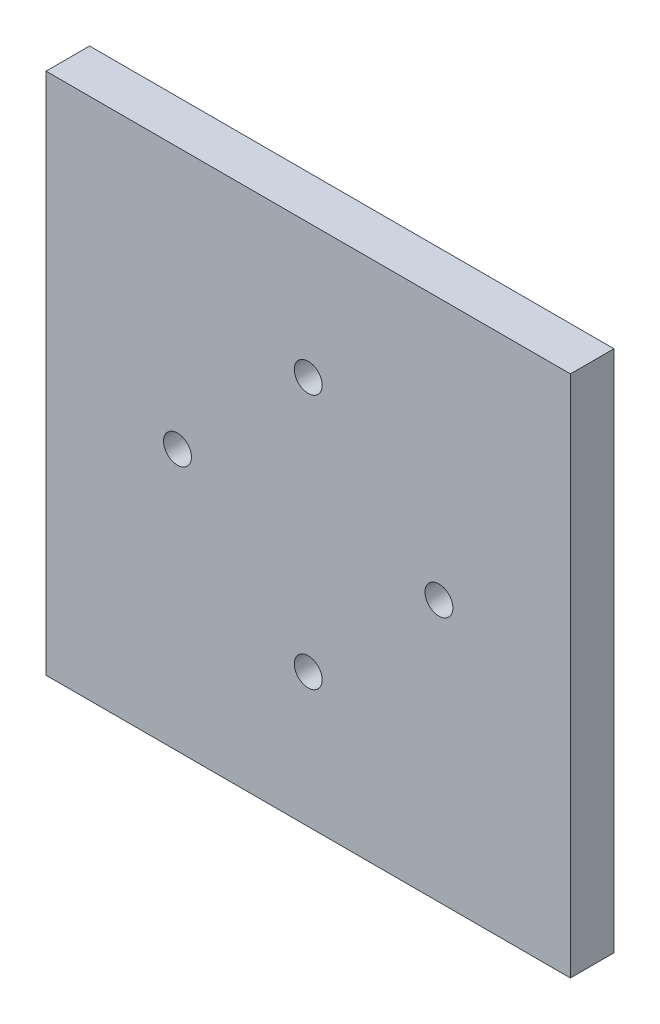
ISO-10303-21;
HEADER;
FILE_DESCRIPTION(('STEP AP214'),'2;1');
FILE_NAME('part.step','',(''),(''),'','','');
FILE_SCHEMA(('AUTOMOTIVE_DESIGN { 1 0 10303 214 1 1 1 1 }'));
ENDSEC;
DATA;
#1=APPLICATION_CONTEXT('core data for automotive mechanical design processes');
#2=APPLICATION_PROTOCOL_DEFINITION('international standard','automotive_design',2000,#1);
#3=PRODUCT_CONTEXT('',#1,'mechanical');
#4=PRODUCT('Part','Part','',(#3));
#5=PRODUCT_RELATED_PRODUCT_CATEGORY('part','',(#4));
#6=PRODUCT_DEFINITION_FORMATION('','',#4);
#7=PRODUCT_DEFINITION_CONTEXT('part definition',#1,'design');
#8=PRODUCT_DEFINITION('design','',#6,#7);
#9=PRODUCT_DEFINITION_SHAPE('','',#8);
#10=(LENGTH_UNIT() NAMED_UNIT(*) SI_UNIT(.MILLI.,.METRE.));
#11=(NAMED_UNIT(*) PLANE_ANGLE_UNIT() SI_UNIT($,.RADIAN.));
#12=(NAMED_UNIT(*) SI_UNIT($,.STERADIAN.) SOLID_ANGLE_UNIT());
#13=UNCERTAINTY_MEASURE_WITH_UNIT(LENGTH_MEASURE(1.E-05),#10,'distance_accuracy_value','');
#14=(GEOMETRIC_REPRESENTATION_CONTEXT(3) GLOBAL_UNCERTAINTY_ASSIGNED_CONTEXT((#13)) GLOBAL_UNIT_ASSIGNED_CONTEXT((#10,
#11,#12)) REPRESENTATION_CONTEXT('',''));
#15=CARTESIAN_POINT('',(0.,0.,0.));
#16=DIRECTION('',(0.,0.,1.));
#17=DIRECTION('',(1.,0.,0.));
#18=AXIS2_PLACEMENT_3D('',#15,#16,#17);
#19=CARTESIAN_POINT('',(35.0334465596278,41.2975167374121,6.35));
#20=DIRECTION('',(0.,0.,-1.));
#21=DIRECTION('',(-1.,0.,0.));
#22=AXIS2_PLACEMENT_3D('',#19,#20,#21);
#23=PLANE('',#22);
#24=CARTESIAN_POINT('',(-3.17499999999997,21.7576695281629,6.35));
#25=DIRECTION('',(0.,0.,1.));
#26=DIRECTION('',(1.,0.,0.));
#27=AXIS2_PLACEMENT_3D('',#24,#25,#26);
#28=CIRCLE('',#27,2.032);
#29=CARTESIAN_POINT('',(-1.14299999999997,21.7576695281629,6.35));
#30=VERTEX_POINT('',#29);
#31=EDGE_CURVE('E119',#30,#30,#28,.T.);
#32=ORIENTED_EDGE('',*,*,#31,.F.);
#33=EDGE_LOOP('',(#32));
#34=FACE_BOUND('',#33,.T.);
#35=CARTESIAN_POINT('',(-22.225,3.175,6.35));
#36=DIRECTION('',(0.,0.,1.));
#37=DIRECTION('',(1.,0.,0.));
#38=AXIS2_PLACEMENT_3D('',#35,#36,#37);
#39=CIRCLE('',#38,2.03200000000001);
#40=CARTESIAN_POINT('',(-20.193,3.175,6.35));
#41=VERTEX_POINT('',#40);
#42=EDGE_CURVE('E98',#41,#41,#39,.T.);
#43=ORIENTED_EDGE('',*,*,#42,.F.);
#44=EDGE_LOOP('',(#43));
#45=FACE_BOUND('',#44,.T.);
#46=DIRECTION('',(0.,1.,0.));
#47=VECTOR('',#46,1.);
#48=CARTESIAN_POINT('',(35.0334465596278,-34.9475167374124,6.35));
#49=LINE('',#48,#47);
#50=CARTESIAN_POINT('',(35.0334465596278,-34.9475167374124,6.35));
#51=VERTEX_POINT('',#50);
#52=CARTESIAN_POINT('',(35.0334465596278,41.2975167374121,6.35));
#53=VERTEX_POINT('',#52);
#54=EDGE_CURVE('E83',#51,#53,#49,.T.);
#55=ORIENTED_EDGE('',*,*,#54,.T.);
#56=DIRECTION('',(-1.,0.,0.));
#57=VECTOR('',#56,1.);
#58=CARTESIAN_POINT('',(-41.3834465596278,41.2975167374121,6.35));
#59=LINE('',#58,#57);
#60=CARTESIAN_POINT('',(-41.3834465596278,41.2975167374121,6.35));
#61=VERTEX_POINT('',#60);
#62=EDGE_CURVE('E78',#53,#61,#59,.T.);
#63=ORIENTED_EDGE('',*,*,#62,.T.);
#64=DIRECTION('',(0.,-1.,0.));
#65=VECTOR('',#64,1.);
#66=CARTESIAN_POINT('',(-41.3834465596278,-34.9475167374124,6.35));
#67=LINE('',#66,#65);
#68=CARTESIAN_POINT('',(-41.3834465596278,-34.9475167374124,6.35));
#69=VERTEX_POINT('',#68);
#70=EDGE_CURVE('E81',#61,#69,#67,.T.);
#71=ORIENTED_EDGE('',*,*,#70,.T.);
#72=DIRECTION('',(1.,0.,0.));
#73=VECTOR('',#72,1.);
#74=CARTESIAN_POINT('',(-41.3834465596278,-34.9475167374124,6.35));
#75=LINE('',#74,#73);
#76=EDGE_CURVE('E48',#69,#51,#75,.T.);
#77=ORIENTED_EDGE('',*,*,#76,.T.);
#78=EDGE_LOOP('',(#55,#63,#71,#77));
#79=FACE_BOUND('',#78,.T.);
#80=CARTESIAN_POINT('',(15.875,3.175,6.35));
#81=DIRECTION('',(0.,0.,1.));
#82=DIRECTION('',(1.,0.,0.));
#83=AXIS2_PLACEMENT_3D('',#80,#81,#82);
#84=CIRCLE('',#83,2.032);
#85=CARTESIAN_POINT('',(17.907,3.175,6.35));
#86=VERTEX_POINT('',#85);
#87=EDGE_CURVE('E113',#86,#86,#84,.T.);
#88=ORIENTED_EDGE('',*,*,#87,.F.);
#89=EDGE_LOOP('',(#88));
#90=FACE_BOUND('',#89,.T.);
#91=CARTESIAN_POINT('',(-3.17499999999997,-15.4076695281628,6.35));
#92=DIRECTION('',(0.,0.,1.));
#93=DIRECTION('',(1.,0.,0.));
#94=AXIS2_PLACEMENT_3D('',#91,#92,#93);
#95=CIRCLE('',#94,2.032);
#96=CARTESIAN_POINT('',(-1.14299999999997,-15.4076695281628,6.35));
#97=VERTEX_POINT('',#96);
#98=EDGE_CURVE('E125',#97,#97,#95,.T.);
#99=ORIENTED_EDGE('',*,*,#98,.F.);
#100=EDGE_LOOP('',(#99));
#101=FACE_BOUND('',#100,.T.);
#102=ADVANCED_FACE('F31',(#34,#45,#79,#90,#101),#23,.F.);
#103=CARTESIAN_POINT('',(35.0334465596278,41.2975167374121,0.));
#104=DIRECTION('',(0.,0.,-1.));
#105=DIRECTION('',(-1.,0.,0.));
#106=AXIS2_PLACEMENT_3D('',#103,#104,#105);
#107=PLANE('',#106);
#108=CARTESIAN_POINT('',(-3.17499999999997,21.7576695281629,0.));
#109=DIRECTION('',(0.,0.,1.));
#110=DIRECTION('',(1.,0.,0.));
#111=AXIS2_PLACEMENT_3D('',#108,#109,#110);
#112=CIRCLE('',#111,2.032);
#113=CARTESIAN_POINT('',(-1.14299999999997,21.7576695281629,0.));
#114=VERTEX_POINT('',#113);
#115=EDGE_CURVE('E122',#114,#114,#112,.T.);
#116=ORIENTED_EDGE('',*,*,#115,.T.);
#117=EDGE_LOOP('',(#116));
#118=FACE_BOUND('',#117,.T.);
#119=CARTESIAN_POINT('',(-22.225,3.175,0.));
#120=DIRECTION('',(0.,0.,1.));
#121=DIRECTION('',(1.,0.,0.));
#122=AXIS2_PLACEMENT_3D('',#119,#120,#121);
#123=CIRCLE('',#122,2.03200000000001);
#124=CARTESIAN_POINT('',(-20.193,3.175,0.));
#125=VERTEX_POINT('',#124);
#126=EDGE_CURVE('E110',#125,#125,#123,.T.);
#127=ORIENTED_EDGE('',*,*,#126,.T.);
#128=EDGE_LOOP('',(#127));
#129=FACE_BOUND('',#128,.T.);
#130=DIRECTION('',(0.,1.,0.));
#131=VECTOR('',#130,1.);
#132=CARTESIAN_POINT('',(35.0334465596278,-34.9475167374124,0.));
#133=LINE('',#132,#131);
#134=CARTESIAN_POINT('',(35.0334465596278,-34.9475167374124,0.));
#135=VERTEX_POINT('',#134);
#136=CARTESIAN_POINT('',(35.0334465596278,41.2975167374121,0.));
#137=VERTEX_POINT('',#136);
#138=EDGE_CURVE('E95',#135,#137,#133,.T.);
#139=ORIENTED_EDGE('',*,*,#138,.F.);
#140=DIRECTION('',(1.,0.,0.));
#141=VECTOR('',#140,1.);
#142=CARTESIAN_POINT('',(-41.3834465596278,-34.9475167374124,0.));
#143=LINE('',#142,#141);
#144=CARTESIAN_POINT('',(-41.3834465596278,-34.9475167374124,0.));
#145=VERTEX_POINT('',#144);
#146=EDGE_CURVE('E71',#145,#135,#143,.T.);
#147=ORIENTED_EDGE('',*,*,#146,.F.);
#148=DIRECTION('',(0.,-1.,0.));
#149=VECTOR('',#148,1.);
#150=CARTESIAN_POINT('',(-41.3834465596278,-34.9475167374124,0.));
#151=LINE('',#150,#149);
#152=CARTESIAN_POINT('',(-41.3834465596278,41.2975167374121,0.));
#153=VERTEX_POINT('',#152);
#154=EDGE_CURVE('E65',#153,#145,#151,.T.);
#155=ORIENTED_EDGE('',*,*,#154,.F.);
#156=DIRECTION('',(-1.,0.,0.));
#157=VECTOR('',#156,1.);
#158=CARTESIAN_POINT('',(-41.3834465596278,41.2975167374121,0.));
#159=LINE('',#158,#157);
#160=EDGE_CURVE('E87',#137,#153,#159,.T.);
#161=ORIENTED_EDGE('',*,*,#160,.F.);
#162=EDGE_LOOP('',(#139,#147,#155,#161));
#163=FACE_BOUND('',#162,.T.);
#164=CARTESIAN_POINT('',(15.875,3.175,0.));
#165=DIRECTION('',(0.,0.,1.));
#166=DIRECTION('',(1.,0.,0.));
#167=AXIS2_PLACEMENT_3D('',#164,#165,#166);
#168=CIRCLE('',#167,2.032);
#169=CARTESIAN_POINT('',(17.907,3.175,0.));
#170=VERTEX_POINT('',#169);
#171=EDGE_CURVE('E116',#170,#170,#168,.T.);
#172=ORIENTED_EDGE('',*,*,#171,.T.);
#173=EDGE_LOOP('',(#172));
#174=FACE_BOUND('',#173,.T.);
#175=CARTESIAN_POINT('',(-3.17499999999997,-15.4076695281628,0.));
#176=DIRECTION('',(0.,0.,1.));
#177=DIRECTION('',(1.,0.,0.));
#178=AXIS2_PLACEMENT_3D('',#175,#176,#177);
#179=CIRCLE('',#178,2.032);
#180=CARTESIAN_POINT('',(-1.14299999999997,-15.4076695281628,0.));
#181=VERTEX_POINT('',#180);
#182=EDGE_CURVE('E128',#181,#181,#179,.T.);
#183=ORIENTED_EDGE('',*,*,#182,.T.);
#184=EDGE_LOOP('',(#183));
#185=FACE_BOUND('',#184,.T.);
#186=ADVANCED_FACE('F106',(#118,#129,#163,#174,#185),#107,.T.);
#187=CARTESIAN_POINT('',(35.0334465596278,-34.9475167374124,6.35));
#188=DIRECTION('',(-1.,0.,0.));
#189=DIRECTION('',(0.,0.,1.));
#190=AXIS2_PLACEMENT_3D('',#187,#188,#189);
#191=PLANE('',#190);
#192=ORIENTED_EDGE('',*,*,#138,.T.);
#193=DIRECTION('',(0.,0.,-1.));
#194=VECTOR('',#193,1.);
#195=CARTESIAN_POINT('',(35.0334465596278,41.2975167374121,6.35));
#196=LINE('',#195,#194);
#197=EDGE_CURVE('E11',#53,#137,#196,.T.);
#198=ORIENTED_EDGE('',*,*,#197,.F.);
#199=ORIENTED_EDGE('',*,*,#54,.F.);
#200=DIRECTION('',(0.,0.,-1.));
#201=VECTOR('',#200,1.);
#202=CARTESIAN_POINT('',(35.0334465596278,-34.9475167374124,6.35));
#203=LINE('',#202,#201);
#204=EDGE_CURVE('E91',#51,#135,#203,.T.);
#205=ORIENTED_EDGE('',*,*,#204,.T.);
#206=EDGE_LOOP('',(#192,#198,#199,#205));
#207=FACE_BOUND('',#206,.T.);
#208=ADVANCED_FACE('F33',(#207),#191,.F.);
#209=CARTESIAN_POINT('',(-41.3834465596278,41.2975167374121,6.35));
#210=DIRECTION('',(0.,-1.,0.));
#211=DIRECTION('',(0.,0.,-1.));
#212=AXIS2_PLACEMENT_3D('',#209,#210,#211);
#213=PLANE('',#212);
#214=ORIENTED_EDGE('',*,*,#160,.T.);
#215=DIRECTION('',(0.,0.,-1.));
#216=VECTOR('',#215,1.);
#217=CARTESIAN_POINT('',(-41.3834465596278,41.2975167374121,6.35));
#218=LINE('',#217,#216);
#219=EDGE_CURVE('E40',#61,#153,#218,.T.);
#220=ORIENTED_EDGE('',*,*,#219,.F.);
#221=ORIENTED_EDGE('',*,*,#62,.F.);
#222=ORIENTED_EDGE('',*,*,#197,.T.);
#223=EDGE_LOOP('',(#214,#220,#221,#222));
#224=FACE_BOUND('',#223,.T.);
#225=ADVANCED_FACE('F86',(#224),#213,.F.);
#226=CARTESIAN_POINT('',(-41.3834465596278,-34.9475167374124,6.35));
#227=DIRECTION('',(1.,0.,0.));
#228=DIRECTION('',(0.,0.,-1.));
#229=AXIS2_PLACEMENT_3D('',#226,#227,#228);
#230=PLANE('',#229);
#231=ORIENTED_EDGE('',*,*,#154,.T.);
#232=DIRECTION('',(0.,0.,-1.));
#233=VECTOR('',#232,1.);
#234=CARTESIAN_POINT('',(-41.3834465596278,-34.9475167374124,6.35));
#235=LINE('',#234,#233);
#236=EDGE_CURVE('E88',#69,#145,#235,.T.);
#237=ORIENTED_EDGE('',*,*,#236,.F.);
#238=ORIENTED_EDGE('',*,*,#70,.F.);
#239=ORIENTED_EDGE('',*,*,#219,.T.);
#240=EDGE_LOOP('',(#231,#237,#238,#239));
#241=FACE_BOUND('',#240,.T.);
#242=ADVANCED_FACE('F89',(#241),#230,.F.);
#243=CARTESIAN_POINT('',(-41.3834465596278,-34.9475167374124,6.35));
#244=DIRECTION('',(0.,1.,0.));
#245=DIRECTION('',(0.,0.,1.));
#246=AXIS2_PLACEMENT_3D('',#243,#244,#245);
#247=PLANE('',#246);
#248=ORIENTED_EDGE('',*,*,#146,.T.);
#249=ORIENTED_EDGE('',*,*,#204,.F.);
#250=ORIENTED_EDGE('',*,*,#76,.F.);
#251=ORIENTED_EDGE('',*,*,#236,.T.);
#252=EDGE_LOOP('',(#248,#249,#250,#251));
#253=FACE_BOUND('',#252,.T.);
#254=ADVANCED_FACE('F103',(#253),#247,.F.);
#255=CARTESIAN_POINT('',(-22.225,3.175,6.35));
#256=DIRECTION('',(0.,0.,-1.));
#257=DIRECTION('',(-1.,0.,0.));
#258=AXIS2_PLACEMENT_3D('',#255,#256,#257);
#259=CYLINDRICAL_SURFACE('',#258,2.03200000000001);
#260=ORIENTED_EDGE('',*,*,#42,.T.);
#261=EDGE_LOOP('',(#260));
#262=FACE_BOUND('',#261,.T.);
#263=ORIENTED_EDGE('',*,*,#126,.F.);
#264=EDGE_LOOP('',(#263));
#265=FACE_BOUND('',#264,.T.);
#266=ADVANCED_FACE('F148',(#262,#265),#259,.F.);
#267=CARTESIAN_POINT('',(15.875,3.175,6.35));
#268=DIRECTION('',(0.,0.,-1.));
#269=DIRECTION('',(-1.,0.,0.));
#270=AXIS2_PLACEMENT_3D('',#267,#268,#269);
#271=CYLINDRICAL_SURFACE('',#270,2.032);
#272=ORIENTED_EDGE('',*,*,#87,.T.);
#273=EDGE_LOOP('',(#272));
#274=FACE_BOUND('',#273,.T.);
#275=ORIENTED_EDGE('',*,*,#171,.F.);
#276=EDGE_LOOP('',(#275));
#277=FACE_BOUND('',#276,.T.);
#278=ADVANCED_FACE('F194',(#274,#277),#271,.F.);
#279=CARTESIAN_POINT('',(-3.17499999999997,21.7576695281629,6.35));
#280=DIRECTION('',(0.,0.,-1.));
#281=DIRECTION('',(-1.,0.,0.));
#282=AXIS2_PLACEMENT_3D('',#279,#280,#281);
#283=CYLINDRICAL_SURFACE('',#282,2.032);
#284=ORIENTED_EDGE('',*,*,#31,.T.);
#285=EDGE_LOOP('',(#284));
#286=FACE_BOUND('',#285,.T.);
#287=ORIENTED_EDGE('',*,*,#115,.F.);
#288=EDGE_LOOP('',(#287));
#289=FACE_BOUND('',#288,.T.);
#290=ADVANCED_FACE('F202',(#286,#289),#283,.F.);
#291=CARTESIAN_POINT('',(-3.17499999999997,-15.4076695281628,6.35));
#292=DIRECTION('',(0.,0.,-1.));
#293=DIRECTION('',(-1.,0.,0.));
#294=AXIS2_PLACEMENT_3D('',#291,#292,#293);
#295=CYLINDRICAL_SURFACE('',#294,2.032);
#296=ORIENTED_EDGE('',*,*,#98,.T.);
#297=EDGE_LOOP('',(#296));
#298=FACE_BOUND('',#297,.T.);
#299=ORIENTED_EDGE('',*,*,#182,.F.);
#300=EDGE_LOOP('',(#299));
#301=FACE_BOUND('',#300,.T.);
#302=ADVANCED_FACE('F134',(#298,#301),#295,.F.);
#303=CLOSED_SHELL('',(#102,#186,#208,#225,#242,#254,#266,#278,#290,#302));
#304=MANIFOLD_SOLID_BREP('B2',#303);
#305=ADVANCED_BREP_SHAPE_REPRESENTATION('',(#18,#304),#14);
#306=SHAPE_DEFINITION_REPRESENTATION(#9,#305);
ENDSEC;
END-ISO-10303-21;
